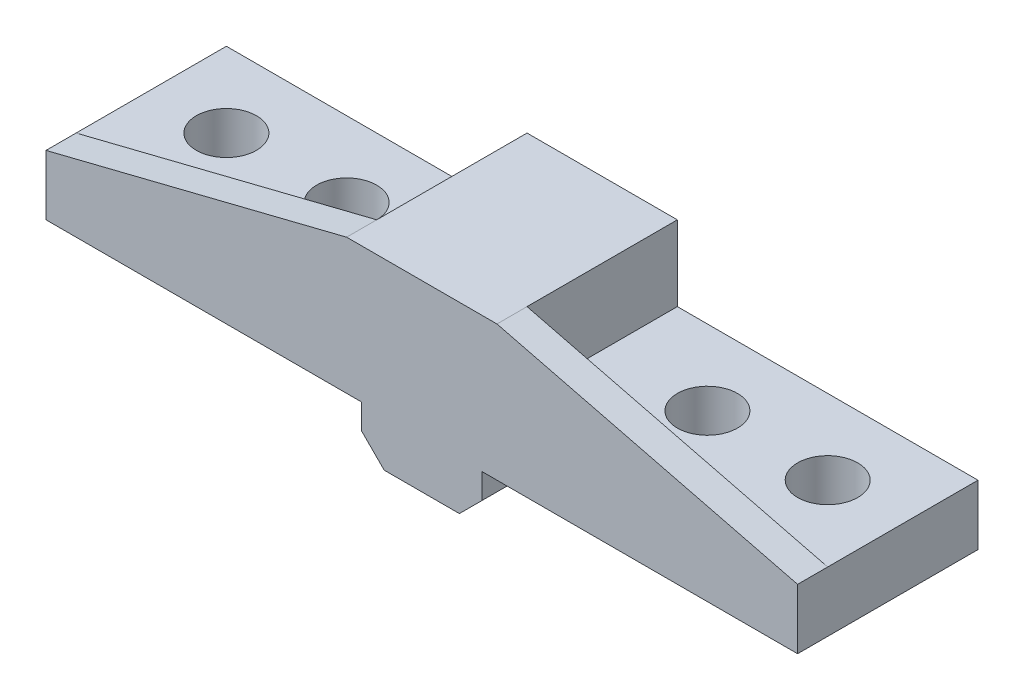
ISO-10303-21;
HEADER;
FILE_DESCRIPTION(('STEP AP214'),'2;1');
FILE_NAME('part.step','',(''),(''),'','','');
FILE_SCHEMA(('AUTOMOTIVE_DESIGN { 1 0 10303 214 1 1 1 1 }'));
ENDSEC;
DATA;
#1=APPLICATION_CONTEXT('core data for automotive mechanical design processes');
#2=APPLICATION_PROTOCOL_DEFINITION('international standard','automotive_design',2000,#1);
#3=PRODUCT_CONTEXT('',#1,'mechanical');
#4=PRODUCT('Part','Part','',(#3));
#5=PRODUCT_RELATED_PRODUCT_CATEGORY('part','',(#4));
#6=PRODUCT_DEFINITION_FORMATION('','',#4);
#7=PRODUCT_DEFINITION_CONTEXT('part definition',#1,'design');
#8=PRODUCT_DEFINITION('design','',#6,#7);
#9=PRODUCT_DEFINITION_SHAPE('','',#8);
#10=(LENGTH_UNIT() NAMED_UNIT(*) SI_UNIT(.MILLI.,.METRE.));
#11=(NAMED_UNIT(*) PLANE_ANGLE_UNIT() SI_UNIT($,.RADIAN.));
#12=(NAMED_UNIT(*) SI_UNIT($,.STERADIAN.) SOLID_ANGLE_UNIT());
#13=UNCERTAINTY_MEASURE_WITH_UNIT(LENGTH_MEASURE(1.E-05),#10,'distance_accuracy_value','');
#14=(GEOMETRIC_REPRESENTATION_CONTEXT(3) GLOBAL_UNCERTAINTY_ASSIGNED_CONTEXT((#13)) GLOBAL_UNIT_ASSIGNED_CONTEXT((#10,
#11,#12)) REPRESENTATION_CONTEXT('',''));
#15=CARTESIAN_POINT('',(0.,0.,0.));
#16=DIRECTION('',(0.,0.,1.));
#17=DIRECTION('',(1.,0.,0.));
#18=AXIS2_PLACEMENT_3D('',#15,#16,#17);
#19=CARTESIAN_POINT('',(-4.,3.175,10.));
#20=DIRECTION('',(0.,1.,0.));
#21=DIRECTION('',(-1.,0.,0.));
#22=AXIS2_PLACEMENT_3D('',#19,#20,#21);
#23=PLANE('',#22);
#24=CARTESIAN_POINT('',(-20.,3.175,5.00000000000001));
#25=DIRECTION('',(0.,1.,0.));
#26=DIRECTION('',(-1.,0.,0.));
#27=AXIS2_PLACEMENT_3D('',#24,#25,#26);
#28=CIRCLE('',#27,2.);
#29=CARTESIAN_POINT('',(-22.,3.175,5.00000000000001));
#30=VERTEX_POINT('',#29);
#31=EDGE_CURVE('E579',#30,#30,#28,.F.);
#32=ORIENTED_EDGE('',*,*,#31,.F.);
#33=EDGE_LOOP('',(#32));
#34=FACE_BOUND('',#33,.T.);
#35=CARTESIAN_POINT('',(-12.,3.175,5.));
#36=DIRECTION('',(0.,1.,0.));
#37=DIRECTION('',(-1.,0.,0.));
#38=AXIS2_PLACEMENT_3D('',#35,#36,#37);
#39=CIRCLE('',#38,2.);
#40=CARTESIAN_POINT('',(-14.,3.175,5.));
#41=VERTEX_POINT('',#40);
#42=EDGE_CURVE('E578',#41,#41,#39,.F.);
#43=ORIENTED_EDGE('',*,*,#42,.F.);
#44=EDGE_LOOP('',(#43));
#45=FACE_BOUND('',#44,.T.);
#46=DIRECTION('',(1.,0.,0.));
#47=VECTOR('',#46,1.);
#48=CARTESIAN_POINT('',(-4.,3.175,0.));
#49=LINE('',#48,#47);
#50=CARTESIAN_POINT('',(-25.,3.175,0.));
#51=VERTEX_POINT('',#50);
#52=CARTESIAN_POINT('',(-4.,3.175,0.));
#53=VERTEX_POINT('',#52);
#54=EDGE_CURVE('E184',#51,#53,#49,.T.);
#55=ORIENTED_EDGE('',*,*,#54,.T.);
#56=DIRECTION('',(0.,0.,-1.));
#57=VECTOR('',#56,1.);
#58=CARTESIAN_POINT('',(-4.,3.175,10.));
#59=LINE('',#58,#57);
#60=CARTESIAN_POINT('',(-4.,3.175,12.));
#61=VERTEX_POINT('',#60);
#62=EDGE_CURVE('E252',#61,#53,#59,.T.);
#63=ORIENTED_EDGE('',*,*,#62,.F.);
#64=DIRECTION('',(1.,0.,0.));
#65=VECTOR('',#64,1.);
#66=CARTESIAN_POINT('',(-4.,3.175,12.));
#67=LINE('',#66,#65);
#68=CARTESIAN_POINT('',(-25.,3.175,12.));
#69=VERTEX_POINT('',#68);
#70=EDGE_CURVE('E569',#69,#61,#67,.T.);
#71=ORIENTED_EDGE('',*,*,#70,.F.);
#72=DIRECTION('',(0.,0.,-1.));
#73=VECTOR('',#72,1.);
#74=CARTESIAN_POINT('',(-25.,3.175,10.));
#75=LINE('',#74,#73);
#76=EDGE_CURVE('E205',#69,#51,#75,.T.);
#77=ORIENTED_EDGE('',*,*,#76,.T.);
#78=EDGE_LOOP('',(#55,#63,#71,#77));
#79=FACE_BOUND('',#78,.T.);
#80=ADVANCED_FACE('F41',(#34,#45,#79),#23,.F.);
#81=CARTESIAN_POINT('',(-4.,0.,10.));
#82=DIRECTION('',(1.,0.,0.));
#83=DIRECTION('',(0.,0.,-1.));
#84=AXIS2_PLACEMENT_3D('',#81,#82,#83);
#85=PLANE('',#84);
#86=DIRECTION('',(0.,-1.,0.));
#87=VECTOR('',#86,1.);
#88=CARTESIAN_POINT('',(-4.,0.,0.));
#89=LINE('',#88,#87);
#90=CARTESIAN_POINT('',(-4.,1.5,0.));
#91=VERTEX_POINT('',#90);
#92=EDGE_CURVE('E187',#53,#91,#89,.T.);
#93=ORIENTED_EDGE('',*,*,#92,.T.);
#94=DIRECTION('',(0.,0.,1.));
#95=VECTOR('',#94,1.);
#96=CARTESIAN_POINT('',(-4.,1.5,10.));
#97=LINE('',#96,#95);
#98=CARTESIAN_POINT('',(-4.,1.5,12.));
#99=VERTEX_POINT('',#98);
#100=EDGE_CURVE('E65',#91,#99,#97,.T.);
#101=ORIENTED_EDGE('',*,*,#100,.T.);
#102=DIRECTION('',(0.,-1.,0.));
#103=VECTOR('',#102,1.);
#104=CARTESIAN_POINT('',(-4.,0.,12.));
#105=LINE('',#104,#103);
#106=EDGE_CURVE('E269',#61,#99,#105,.T.);
#107=ORIENTED_EDGE('',*,*,#106,.F.);
#108=ORIENTED_EDGE('',*,*,#62,.T.);
#109=EDGE_LOOP('',(#93,#101,#107,#108));
#110=FACE_BOUND('',#109,.T.);
#111=ADVANCED_FACE('F282',(#110),#85,.F.);
#112=CARTESIAN_POINT('',(4.,0.,10.));
#113=DIRECTION('',(0.,1.,0.));
#114=DIRECTION('',(-1.,0.,0.));
#115=AXIS2_PLACEMENT_3D('',#112,#113,#114);
#116=PLANE('',#115);
#117=DIRECTION('',(1.,0.,0.));
#118=VECTOR('',#117,1.);
#119=CARTESIAN_POINT('',(4.,0.,12.));
#120=LINE('',#119,#118);
#121=CARTESIAN_POINT('',(-2.50000000000001,0.,12.));
#122=VERTEX_POINT('',#121);
#123=CARTESIAN_POINT('',(2.49999999999998,0.,12.));
#124=VERTEX_POINT('',#123);
#125=EDGE_CURVE('E267',#122,#124,#120,.T.);
#126=ORIENTED_EDGE('',*,*,#125,.F.);
#127=DIRECTION('',(0.,0.,-1.));
#128=VECTOR('',#127,1.);
#129=CARTESIAN_POINT('',(-2.50000000000001,0.,10.));
#130=LINE('',#129,#128);
#131=CARTESIAN_POINT('',(-2.50000000000001,0.,0.));
#132=VERTEX_POINT('',#131);
#133=EDGE_CURVE('E257',#122,#132,#130,.T.);
#134=ORIENTED_EDGE('',*,*,#133,.T.);
#135=DIRECTION('',(1.,0.,0.));
#136=VECTOR('',#135,1.);
#137=CARTESIAN_POINT('',(4.,0.,0.));
#138=LINE('',#137,#136);
#139=CARTESIAN_POINT('',(2.49999999999998,0.,0.));
#140=VERTEX_POINT('',#139);
#141=EDGE_CURVE('E208',#132,#140,#138,.T.);
#142=ORIENTED_EDGE('',*,*,#141,.T.);
#143=DIRECTION('',(0.,0.,1.));
#144=VECTOR('',#143,1.);
#145=CARTESIAN_POINT('',(2.49999999999998,0.,10.));
#146=LINE('',#145,#144);
#147=EDGE_CURVE('E255',#140,#124,#146,.T.);
#148=ORIENTED_EDGE('',*,*,#147,.T.);
#149=EDGE_LOOP('',(#126,#134,#142,#148));
#150=FACE_BOUND('',#149,.T.);
#151=ADVANCED_FACE('F273',(#150),#116,.F.);
#152=CARTESIAN_POINT('',(4.,0.,10.));
#153=DIRECTION('',(-1.,0.,0.));
#154=DIRECTION('',(0.,-1.,0.));
#155=AXIS2_PLACEMENT_3D('',#152,#153,#154);
#156=PLANE('',#155);
#157=DIRECTION('',(0.,1.,0.));
#158=VECTOR('',#157,1.);
#159=CARTESIAN_POINT('',(4.,3.17500000000001,12.));
#160=LINE('',#159,#158);
#161=CARTESIAN_POINT('',(4.,1.50000000000001,12.));
#162=VERTEX_POINT('',#161);
#163=CARTESIAN_POINT('',(4.,3.17500000000001,12.));
#164=VERTEX_POINT('',#163);
#165=EDGE_CURVE('E276',#162,#164,#160,.T.);
#166=ORIENTED_EDGE('',*,*,#165,.F.);
#167=DIRECTION('',(0.,0.,-1.));
#168=VECTOR('',#167,1.);
#169=CARTESIAN_POINT('',(4.,1.50000000000001,10.));
#170=LINE('',#169,#168);
#171=CARTESIAN_POINT('',(4.,1.50000000000001,0.));
#172=VERTEX_POINT('',#171);
#173=EDGE_CURVE('E11',#162,#172,#170,.T.);
#174=ORIENTED_EDGE('',*,*,#173,.T.);
#175=DIRECTION('',(0.,1.,0.));
#176=VECTOR('',#175,1.);
#177=CARTESIAN_POINT('',(4.,0.,0.));
#178=LINE('',#177,#176);
#179=CARTESIAN_POINT('',(4.,3.17500000000001,0.));
#180=VERTEX_POINT('',#179);
#181=EDGE_CURVE('E211',#172,#180,#178,.T.);
#182=ORIENTED_EDGE('',*,*,#181,.T.);
#183=DIRECTION('',(0.,0.,-1.));
#184=VECTOR('',#183,1.);
#185=CARTESIAN_POINT('',(4.,3.17500000000001,10.));
#186=LINE('',#185,#184);
#187=EDGE_CURVE('E249',#164,#180,#186,.T.);
#188=ORIENTED_EDGE('',*,*,#187,.F.);
#189=EDGE_LOOP('',(#166,#174,#182,#188));
#190=FACE_BOUND('',#189,.T.);
#191=ADVANCED_FACE('F472',(#190),#156,.F.);
#192=CARTESIAN_POINT('',(4.,3.17500000000001,10.));
#193=DIRECTION('',(0.,1.,0.));
#194=DIRECTION('',(-1.,0.,0.));
#195=AXIS2_PLACEMENT_3D('',#192,#193,#194);
#196=PLANE('',#195);
#197=CARTESIAN_POINT('',(20.,3.175,5.));
#198=DIRECTION('',(0.,1.,0.));
#199=DIRECTION('',(-1.,0.,0.));
#200=AXIS2_PLACEMENT_3D('',#197,#198,#199);
#201=CIRCLE('',#200,2.);
#202=CARTESIAN_POINT('',(18.,3.175,5.));
#203=VERTEX_POINT('',#202);
#204=EDGE_CURVE('E585',#203,#203,#201,.F.);
#205=ORIENTED_EDGE('',*,*,#204,.F.);
#206=EDGE_LOOP('',(#205));
#207=FACE_BOUND('',#206,.T.);
#208=CARTESIAN_POINT('',(12.,3.175,5.));
#209=DIRECTION('',(0.,1.,0.));
#210=DIRECTION('',(-1.,0.,0.));
#211=AXIS2_PLACEMENT_3D('',#208,#209,#210);
#212=CIRCLE('',#211,2.);
#213=CARTESIAN_POINT('',(9.99999999999999,3.175,5.));
#214=VERTEX_POINT('',#213);
#215=EDGE_CURVE('E297',#214,#214,#212,.F.);
#216=ORIENTED_EDGE('',*,*,#215,.F.);
#217=EDGE_LOOP('',(#216));
#218=FACE_BOUND('',#217,.T.);
#219=DIRECTION('',(1.,0.,0.));
#220=VECTOR('',#219,1.);
#221=CARTESIAN_POINT('',(4.,3.17500000000001,0.));
#222=LINE('',#221,#220);
#223=CARTESIAN_POINT('',(25.,3.175,0.));
#224=VERTEX_POINT('',#223);
#225=EDGE_CURVE('E213',#180,#224,#222,.T.);
#226=ORIENTED_EDGE('',*,*,#225,.T.);
#227=DIRECTION('',(0.,0.,-1.));
#228=VECTOR('',#227,1.);
#229=CARTESIAN_POINT('',(25.,3.175,10.));
#230=LINE('',#229,#228);
#231=CARTESIAN_POINT('',(25.,3.175,12.));
#232=VERTEX_POINT('',#231);
#233=EDGE_CURVE('E246',#232,#224,#230,.T.);
#234=ORIENTED_EDGE('',*,*,#233,.F.);
#235=DIRECTION('',(1.,0.,0.));
#236=VECTOR('',#235,1.);
#237=CARTESIAN_POINT('',(25.,3.175,12.));
#238=LINE('',#237,#236);
#239=EDGE_CURVE('E560',#164,#232,#238,.T.);
#240=ORIENTED_EDGE('',*,*,#239,.F.);
#241=ORIENTED_EDGE('',*,*,#187,.T.);
#242=EDGE_LOOP('',(#226,#234,#240,#241));
#243=FACE_BOUND('',#242,.T.);
#244=ADVANCED_FACE('F469',(#207,#218,#243),#196,.F.);
#245=CARTESIAN_POINT('',(25.,3.175,10.));
#246=DIRECTION('',(-1.,0.,0.));
#247=DIRECTION('',(0.,-1.,0.));
#248=AXIS2_PLACEMENT_3D('',#245,#246,#247);
#249=PLANE('',#248);
#250=DIRECTION('',(0.,1.,0.));
#251=VECTOR('',#250,1.);
#252=CARTESIAN_POINT('',(25.,3.175,0.));
#253=LINE('',#252,#251);
#254=CARTESIAN_POINT('',(25.,7.175,0.));
#255=VERTEX_POINT('',#254);
#256=EDGE_CURVE('E215',#224,#255,#253,.T.);
#257=ORIENTED_EDGE('',*,*,#256,.T.);
#258=DIRECTION('',(0.,0.,-1.));
#259=VECTOR('',#258,1.);
#260=CARTESIAN_POINT('',(25.,7.175,10.));
#261=LINE('',#260,#259);
#262=CARTESIAN_POINT('',(25.,7.175,10.));
#263=VERTEX_POINT('',#262);
#264=EDGE_CURVE('E243',#263,#255,#261,.T.);
#265=ORIENTED_EDGE('',*,*,#264,.F.);
#266=DIRECTION('',(0.,0.,-1.));
#267=VECTOR('',#266,1.);
#268=CARTESIAN_POINT('',(25.,7.175,12.));
#269=LINE('',#268,#267);
#270=CARTESIAN_POINT('',(25.,7.175,12.));
#271=VERTEX_POINT('',#270);
#272=EDGE_CURVE('E189',#271,#263,#269,.T.);
#273=ORIENTED_EDGE('',*,*,#272,.F.);
#274=DIRECTION('',(0.,1.,0.));
#275=VECTOR('',#274,1.);
#276=CARTESIAN_POINT('',(25.,3.175,12.));
#277=LINE('',#276,#275);
#278=EDGE_CURVE('E565',#232,#271,#277,.T.);
#279=ORIENTED_EDGE('',*,*,#278,.F.);
#280=ORIENTED_EDGE('',*,*,#233,.T.);
#281=EDGE_LOOP('',(#257,#265,#273,#279,#280));
#282=FACE_BOUND('',#281,.T.);
#283=ADVANCED_FACE('F461',(#282),#249,.F.);
#284=CARTESIAN_POINT('',(25.,7.175,10.));
#285=DIRECTION('',(0.,-1.,0.));
#286=DIRECTION('',(1.,0.,0.));
#287=AXIS2_PLACEMENT_3D('',#284,#285,#286);
#288=PLANE('',#287);
#289=CARTESIAN_POINT('',(20.,7.175,5.));
#290=DIRECTION('',(0.,1.,0.));
#291=DIRECTION('',(-1.,0.,0.));
#292=AXIS2_PLACEMENT_3D('',#289,#290,#291);
#293=CIRCLE('',#292,2.);
#294=CARTESIAN_POINT('',(18.,7.175,5.));
#295=VERTEX_POINT('',#294);
#296=EDGE_CURVE('E574',#295,#295,#293,.T.);
#297=ORIENTED_EDGE('',*,*,#296,.F.);
#298=EDGE_LOOP('',(#297));
#299=FACE_BOUND('',#298,.T.);
#300=CARTESIAN_POINT('',(12.,7.175,5.));
#301=DIRECTION('',(0.,1.,0.));
#302=DIRECTION('',(-1.,0.,0.));
#303=AXIS2_PLACEMENT_3D('',#300,#301,#302);
#304=CIRCLE('',#303,2.);
#305=CARTESIAN_POINT('',(9.99999999999999,7.175,5.));
#306=VERTEX_POINT('',#305);
#307=EDGE_CURVE('E302',#306,#306,#304,.T.);
#308=ORIENTED_EDGE('',*,*,#307,.F.);
#309=EDGE_LOOP('',(#308));
#310=FACE_BOUND('',#309,.T.);
#311=DIRECTION('',(-1.,0.,0.));
#312=VECTOR('',#311,1.);
#313=CARTESIAN_POINT('',(25.,7.175,0.));
#314=LINE('',#313,#312);
#315=CARTESIAN_POINT('',(5.,7.175,0.));
#316=VERTEX_POINT('',#315);
#317=EDGE_CURVE('E217',#255,#316,#314,.T.);
#318=ORIENTED_EDGE('',*,*,#317,.T.);
#319=DIRECTION('',(0.,0.,-1.));
#320=VECTOR('',#319,1.);
#321=CARTESIAN_POINT('',(5.,7.175,10.));
#322=LINE('',#321,#320);
#323=CARTESIAN_POINT('',(5.,7.175,10.));
#324=VERTEX_POINT('',#323);
#325=EDGE_CURVE('E240',#324,#316,#322,.T.);
#326=ORIENTED_EDGE('',*,*,#325,.F.);
#327=DIRECTION('',(-1.,0.,0.));
#328=VECTOR('',#327,1.);
#329=CARTESIAN_POINT('',(25.,7.175,10.));
#330=LINE('',#329,#328);
#331=EDGE_CURVE('E193',#263,#324,#330,.T.);
#332=ORIENTED_EDGE('',*,*,#331,.F.);
#333=ORIENTED_EDGE('',*,*,#264,.T.);
#334=EDGE_LOOP('',(#318,#326,#332,#333));
#335=FACE_BOUND('',#334,.T.);
#336=ADVANCED_FACE('F458',(#299,#310,#335),#288,.F.);
#337=CARTESIAN_POINT('',(5.,7.175,10.));
#338=DIRECTION('',(-1.,0.,0.));
#339=DIRECTION('',(0.,-1.,0.));
#340=AXIS2_PLACEMENT_3D('',#337,#338,#339);
#341=PLANE('',#340);
#342=DIRECTION('',(0.,1.,0.));
#343=VECTOR('',#342,1.);
#344=CARTESIAN_POINT('',(5.,7.175,0.));
#345=LINE('',#344,#343);
#346=CARTESIAN_POINT('',(5.,12.175,0.));
#347=VERTEX_POINT('',#346);
#348=EDGE_CURVE('E219',#316,#347,#345,.T.);
#349=ORIENTED_EDGE('',*,*,#348,.T.);
#350=DIRECTION('',(0.,0.,-1.));
#351=VECTOR('',#350,1.);
#352=CARTESIAN_POINT('',(5.,12.175,10.));
#353=LINE('',#352,#351);
#354=CARTESIAN_POINT('',(5.,12.175,10.));
#355=VERTEX_POINT('',#354);
#356=EDGE_CURVE('E237',#355,#347,#353,.T.);
#357=ORIENTED_EDGE('',*,*,#356,.F.);
#358=DIRECTION('',(0.,1.,0.));
#359=VECTOR('',#358,1.);
#360=CARTESIAN_POINT('',(5.,7.175,10.));
#361=LINE('',#360,#359);
#362=EDGE_CURVE('E196',#324,#355,#361,.T.);
#363=ORIENTED_EDGE('',*,*,#362,.F.);
#364=ORIENTED_EDGE('',*,*,#325,.T.);
#365=EDGE_LOOP('',(#349,#357,#363,#364));
#366=FACE_BOUND('',#365,.T.);
#367=ADVANCED_FACE('F320',(#366),#341,.F.);
#368=CARTESIAN_POINT('',(-5.,12.175,10.));
#369=DIRECTION('',(0.,-1.,0.));
#370=DIRECTION('',(1.,0.,0.));
#371=AXIS2_PLACEMENT_3D('',#368,#369,#370);
#372=PLANE('',#371);
#373=DIRECTION('',(-1.,0.,0.));
#374=VECTOR('',#373,1.);
#375=CARTESIAN_POINT('',(-5.,12.175,0.));
#376=LINE('',#375,#374);
#377=CARTESIAN_POINT('',(-5.,12.175,0.));
#378=VERTEX_POINT('',#377);
#379=EDGE_CURVE('E221',#347,#378,#376,.T.);
#380=ORIENTED_EDGE('',*,*,#379,.T.);
#381=DIRECTION('',(0.,0.,-1.));
#382=VECTOR('',#381,1.);
#383=CARTESIAN_POINT('',(-5.,12.175,10.));
#384=LINE('',#383,#382);
#385=CARTESIAN_POINT('',(-5.,12.175,10.));
#386=VERTEX_POINT('',#385);
#387=EDGE_CURVE('E182',#386,#378,#384,.T.);
#388=ORIENTED_EDGE('',*,*,#387,.F.);
#389=DIRECTION('',(0.,0.,-1.));
#390=VECTOR('',#389,1.);
#391=CARTESIAN_POINT('',(-5.,12.175,12.));
#392=LINE('',#391,#390);
#393=CARTESIAN_POINT('',(-5.,12.175,12.));
#394=VERTEX_POINT('',#393);
#395=EDGE_CURVE('E163',#394,#386,#392,.T.);
#396=ORIENTED_EDGE('',*,*,#395,.F.);
#397=DIRECTION('',(-1.,0.,0.));
#398=VECTOR('',#397,1.);
#399=CARTESIAN_POINT('',(5.,12.175,12.));
#400=LINE('',#399,#398);
#401=CARTESIAN_POINT('',(5.,12.175,12.));
#402=VERTEX_POINT('',#401);
#403=EDGE_CURVE('E169',#402,#394,#400,.T.);
#404=ORIENTED_EDGE('',*,*,#403,.F.);
#405=DIRECTION('',(0.,0.,-1.));
#406=VECTOR('',#405,1.);
#407=CARTESIAN_POINT('',(5.,12.175,12.));
#408=LINE('',#407,#406);
#409=EDGE_CURVE('E307',#402,#355,#408,.T.);
#410=ORIENTED_EDGE('',*,*,#409,.T.);
#411=ORIENTED_EDGE('',*,*,#356,.T.);
#412=EDGE_LOOP('',(#380,#388,#396,#404,#410,#411));
#413=FACE_BOUND('',#412,.T.);
#414=ADVANCED_FACE('F180',(#413),#372,.F.);
#415=CARTESIAN_POINT('',(-5.,7.175,10.));
#416=DIRECTION('',(1.,0.,0.));
#417=DIRECTION('',(0.,0.,-1.));
#418=AXIS2_PLACEMENT_3D('',#415,#416,#417);
#419=PLANE('',#418);
#420=DIRECTION('',(0.,-1.,0.));
#421=VECTOR('',#420,1.);
#422=CARTESIAN_POINT('',(-5.,7.175,0.));
#423=LINE('',#422,#421);
#424=CARTESIAN_POINT('',(-5.,7.175,0.));
#425=VERTEX_POINT('',#424);
#426=EDGE_CURVE('E223',#378,#425,#423,.T.);
#427=ORIENTED_EDGE('',*,*,#426,.T.);
#428=DIRECTION('',(0.,0.,-1.));
#429=VECTOR('',#428,1.);
#430=CARTESIAN_POINT('',(-5.,7.175,10.));
#431=LINE('',#430,#429);
#432=CARTESIAN_POINT('',(-5.,7.175,10.));
#433=VERTEX_POINT('',#432);
#434=EDGE_CURVE('E233',#433,#425,#431,.T.);
#435=ORIENTED_EDGE('',*,*,#434,.F.);
#436=DIRECTION('',(0.,-1.,0.));
#437=VECTOR('',#436,1.);
#438=CARTESIAN_POINT('',(-5.,7.175,10.));
#439=LINE('',#438,#437);
#440=EDGE_CURVE('E200',#386,#433,#439,.T.);
#441=ORIENTED_EDGE('',*,*,#440,.F.);
#442=ORIENTED_EDGE('',*,*,#387,.T.);
#443=EDGE_LOOP('',(#427,#435,#441,#442));
#444=FACE_BOUND('',#443,.T.);
#445=ADVANCED_FACE('F325',(#444),#419,.F.);
#446=CARTESIAN_POINT('',(-25.,7.175,10.));
#447=DIRECTION('',(0.,-1.,0.));
#448=DIRECTION('',(1.,0.,0.));
#449=AXIS2_PLACEMENT_3D('',#446,#447,#448);
#450=PLANE('',#449);
#451=CARTESIAN_POINT('',(-20.,7.17499999999999,5.00000000000001));
#452=DIRECTION('',(0.,1.,0.));
#453=DIRECTION('',(1.,0.,0.));
#454=AXIS2_PLACEMENT_3D('',#451,#452,#453);
#455=CIRCLE('',#454,2.);
#456=CARTESIAN_POINT('',(-18.,7.17499999999999,5.00000000000001));
#457=VERTEX_POINT('',#456);
#458=EDGE_CURVE('E575',#457,#457,#455,.T.);
#459=ORIENTED_EDGE('',*,*,#458,.F.);
#460=EDGE_LOOP('',(#459));
#461=FACE_BOUND('',#460,.T.);
#462=CARTESIAN_POINT('',(-12.,7.175,5.));
#463=DIRECTION('',(0.,1.,0.));
#464=DIRECTION('',(1.,0.,0.));
#465=AXIS2_PLACEMENT_3D('',#462,#463,#464);
#466=CIRCLE('',#465,2.);
#467=CARTESIAN_POINT('',(-10.,7.175,5.));
#468=VERTEX_POINT('',#467);
#469=EDGE_CURVE('E582',#468,#468,#466,.T.);
#470=ORIENTED_EDGE('',*,*,#469,.F.);
#471=EDGE_LOOP('',(#470));
#472=FACE_BOUND('',#471,.T.);
#473=DIRECTION('',(-1.,0.,0.));
#474=VECTOR('',#473,1.);
#475=CARTESIAN_POINT('',(-25.,7.175,0.));
#476=LINE('',#475,#474);
#477=CARTESIAN_POINT('',(-25.,7.175,0.));
#478=VERTEX_POINT('',#477);
#479=EDGE_CURVE('E225',#425,#478,#476,.T.);
#480=ORIENTED_EDGE('',*,*,#479,.T.);
#481=DIRECTION('',(0.,0.,-1.));
#482=VECTOR('',#481,1.);
#483=CARTESIAN_POINT('',(-25.,7.175,10.));
#484=LINE('',#483,#482);
#485=CARTESIAN_POINT('',(-25.,7.175,10.));
#486=VERTEX_POINT('',#485);
#487=EDGE_CURVE('E230',#486,#478,#484,.T.);
#488=ORIENTED_EDGE('',*,*,#487,.F.);
#489=DIRECTION('',(-1.,0.,0.));
#490=VECTOR('',#489,1.);
#491=CARTESIAN_POINT('',(-25.,7.175,10.));
#492=LINE('',#491,#490);
#493=EDGE_CURVE('E203',#433,#486,#492,.T.);
#494=ORIENTED_EDGE('',*,*,#493,.F.);
#495=ORIENTED_EDGE('',*,*,#434,.T.);
#496=EDGE_LOOP('',(#480,#488,#494,#495));
#497=FACE_BOUND('',#496,.T.);
#498=ADVANCED_FACE('F292',(#461,#472,#497),#450,.F.);
#499=CARTESIAN_POINT('',(-25.,3.175,10.));
#500=DIRECTION('',(1.,0.,0.));
#501=DIRECTION('',(0.,1.,0.));
#502=AXIS2_PLACEMENT_3D('',#499,#500,#501);
#503=PLANE('',#502);
#504=DIRECTION('',(0.,-1.,0.));
#505=VECTOR('',#504,1.);
#506=CARTESIAN_POINT('',(-25.,3.175,0.));
#507=LINE('',#506,#505);
#508=EDGE_CURVE('E197',#478,#51,#507,.T.);
#509=ORIENTED_EDGE('',*,*,#508,.T.);
#510=ORIENTED_EDGE('',*,*,#76,.F.);
#511=DIRECTION('',(0.,-1.,0.));
#512=VECTOR('',#511,1.);
#513=CARTESIAN_POINT('',(-25.,7.175,12.));
#514=LINE('',#513,#512);
#515=CARTESIAN_POINT('',(-25.,7.175,12.));
#516=VERTEX_POINT('',#515);
#517=EDGE_CURVE('E168',#516,#69,#514,.T.);
#518=ORIENTED_EDGE('',*,*,#517,.F.);
#519=DIRECTION('',(0.,0.,-1.));
#520=VECTOR('',#519,1.);
#521=CARTESIAN_POINT('',(-25.,7.175,12.));
#522=LINE('',#521,#520);
#523=EDGE_CURVE('E165',#516,#486,#522,.T.);
#524=ORIENTED_EDGE('',*,*,#523,.T.);
#525=ORIENTED_EDGE('',*,*,#487,.T.);
#526=EDGE_LOOP('',(#509,#510,#518,#524,#525));
#527=FACE_BOUND('',#526,.T.);
#528=ADVANCED_FACE('F289',(#527),#503,.F.);
#529=CARTESIAN_POINT('',(0.,0.,0.));
#530=DIRECTION('',(0.,0.,-1.));
#531=DIRECTION('',(-1.,0.,0.));
#532=AXIS2_PLACEMENT_3D('',#529,#530,#531);
#533=PLANE('',#532);
#534=ORIENTED_EDGE('',*,*,#141,.F.);
#535=DIRECTION('',(0.707106781186546,-0.707106781186549,0.));
#536=VECTOR('',#535,1.);
#537=CARTESIAN_POINT('',(-1.25000000000001,-1.25000000000001,0.));
#538=LINE('',#537,#536);
#539=EDGE_CURVE('E262',#132,#91,#538,.F.);
#540=ORIENTED_EDGE('',*,*,#539,.T.);
#541=ORIENTED_EDGE('',*,*,#92,.F.);
#542=ORIENTED_EDGE('',*,*,#54,.F.);
#543=ORIENTED_EDGE('',*,*,#508,.F.);
#544=ORIENTED_EDGE('',*,*,#479,.F.);
#545=ORIENTED_EDGE('',*,*,#426,.F.);
#546=ORIENTED_EDGE('',*,*,#379,.F.);
#547=ORIENTED_EDGE('',*,*,#348,.F.);
#548=ORIENTED_EDGE('',*,*,#317,.F.);
#549=ORIENTED_EDGE('',*,*,#256,.F.);
#550=ORIENTED_EDGE('',*,*,#225,.F.);
#551=ORIENTED_EDGE('',*,*,#181,.F.);
#552=DIRECTION('',(0.707106781186549,0.707106781186546,0.));
#553=VECTOR('',#552,1.);
#554=CARTESIAN_POINT('',(1.24999999999998,-1.24999999999999,0.));
#555=LINE('',#554,#553);
#556=EDGE_CURVE('E260',#172,#140,#555,.F.);
#557=ORIENTED_EDGE('',*,*,#556,.T.);
#558=EDGE_LOOP('',(#534,#540,#541,#542,#543,#544,#545,#546,#547,#548,#549,#550,#551,#557));
#559=FACE_BOUND('',#558,.T.);
#560=ADVANCED_FACE('F280',(#559),#533,.T.);
#561=CARTESIAN_POINT('',(0.,0.,10.));
#562=DIRECTION('',(0.,0.,1.));
#563=DIRECTION('',(1.,0.,0.));
#564=AXIS2_PLACEMENT_3D('',#561,#562,#563);
#565=PLANE('',#564);
#566=DIRECTION('',(-0.970142500145332,0.242535625036333,0.));
#567=VECTOR('',#566,1.);
#568=CARTESIAN_POINT('',(25.,7.175,10.));
#569=LINE('',#568,#567);
#570=EDGE_CURVE('E178',#263,#355,#569,.T.);
#571=ORIENTED_EDGE('',*,*,#570,.F.);
#572=ORIENTED_EDGE('',*,*,#331,.T.);
#573=ORIENTED_EDGE('',*,*,#362,.T.);
#574=EDGE_LOOP('',(#571,#572,#573));
#575=FACE_BOUND('',#574,.T.);
#576=ADVANCED_FACE('F316',(#575),#565,.F.);
#577=DIRECTION('',(-0.970142500145332,-0.242535625036333,0.));
#578=VECTOR('',#577,1.);
#579=CARTESIAN_POINT('',(-5.,12.175,10.));
#580=LINE('',#579,#578);
#581=EDGE_CURVE('E296',#386,#486,#580,.T.);
#582=ORIENTED_EDGE('',*,*,#581,.F.);
#583=ORIENTED_EDGE('',*,*,#440,.T.);
#584=ORIENTED_EDGE('',*,*,#493,.T.);
#585=EDGE_LOOP('',(#582,#583,#584));
#586=FACE_BOUND('',#585,.T.);
#587=ADVANCED_FACE('F295',(#586),#565,.F.);
#588=CARTESIAN_POINT('',(-5.,12.175,12.));
#589=DIRECTION('',(0.242535625036333,-0.970142500145332,0.));
#590=DIRECTION('',(0.970142500145332,0.242535625036333,0.));
#591=AXIS2_PLACEMENT_3D('',#588,#589,#590);
#592=PLANE('',#591);
#593=ORIENTED_EDGE('',*,*,#581,.T.);
#594=ORIENTED_EDGE('',*,*,#523,.F.);
#595=DIRECTION('',(-0.970142500145332,-0.242535625036333,0.));
#596=VECTOR('',#595,1.);
#597=CARTESIAN_POINT('',(-5.,12.175,12.));
#598=LINE('',#597,#596);
#599=EDGE_CURVE('E158',#394,#516,#598,.T.);
#600=ORIENTED_EDGE('',*,*,#599,.F.);
#601=ORIENTED_EDGE('',*,*,#395,.T.);
#602=EDGE_LOOP('',(#593,#594,#600,#601));
#603=FACE_BOUND('',#602,.T.);
#604=ADVANCED_FACE('F161',(#603),#592,.F.);
#605=CARTESIAN_POINT('',(25.,7.175,12.));
#606=DIRECTION('',(-0.242535625036333,-0.970142500145332,0.));
#607=DIRECTION('',(0.970142500145332,-0.242535625036333,0.));
#608=AXIS2_PLACEMENT_3D('',#605,#606,#607);
#609=PLANE('',#608);
#610=ORIENTED_EDGE('',*,*,#570,.T.);
#611=ORIENTED_EDGE('',*,*,#409,.F.);
#612=DIRECTION('',(-0.970142500145332,0.242535625036333,0.));
#613=VECTOR('',#612,1.);
#614=CARTESIAN_POINT('',(25.,7.175,12.));
#615=LINE('',#614,#613);
#616=EDGE_CURVE('E174',#271,#402,#615,.T.);
#617=ORIENTED_EDGE('',*,*,#616,.F.);
#618=ORIENTED_EDGE('',*,*,#272,.T.);
#619=EDGE_LOOP('',(#610,#611,#617,#618));
#620=FACE_BOUND('',#619,.T.);
#621=ADVANCED_FACE('F312',(#620),#609,.F.);
#622=CARTESIAN_POINT('',(0.,0.,12.));
#623=DIRECTION('',(0.,0.,1.));
#624=DIRECTION('',(1.,0.,0.));
#625=AXIS2_PLACEMENT_3D('',#622,#623,#624);
#626=PLANE('',#625);
#627=ORIENTED_EDGE('',*,*,#106,.T.);
#628=DIRECTION('',(-0.707106781186546,0.707106781186549,0.));
#629=VECTOR('',#628,1.);
#630=CARTESIAN_POINT('',(-1.25000000000001,-1.25000000000001,12.));
#631=LINE('',#630,#629);
#632=EDGE_CURVE('E50',#99,#122,#631,.F.);
#633=ORIENTED_EDGE('',*,*,#632,.T.);
#634=ORIENTED_EDGE('',*,*,#125,.T.);
#635=DIRECTION('',(-0.707106781186549,-0.707106781186546,0.));
#636=VECTOR('',#635,1.);
#637=CARTESIAN_POINT('',(1.24999999999998,-1.24999999999999,12.));
#638=LINE('',#637,#636);
#639=EDGE_CURVE('E57',#124,#162,#638,.F.);
#640=ORIENTED_EDGE('',*,*,#639,.T.);
#641=ORIENTED_EDGE('',*,*,#165,.T.);
#642=ORIENTED_EDGE('',*,*,#239,.T.);
#643=ORIENTED_EDGE('',*,*,#278,.T.);
#644=ORIENTED_EDGE('',*,*,#616,.T.);
#645=ORIENTED_EDGE('',*,*,#403,.T.);
#646=ORIENTED_EDGE('',*,*,#599,.T.);
#647=ORIENTED_EDGE('',*,*,#517,.T.);
#648=ORIENTED_EDGE('',*,*,#70,.T.);
#649=EDGE_LOOP('',(#627,#633,#634,#640,#641,#642,#643,#644,#645,#646,#647,#648));
#650=FACE_BOUND('',#649,.T.);
#651=ADVANCED_FACE('F172',(#650),#626,.T.);
#652=CARTESIAN_POINT('',(-12.,-2.48185424949239,5.));
#653=DIRECTION('',(0.,1.,0.));
#654=DIRECTION('',(-1.,0.,0.));
#655=AXIS2_PLACEMENT_3D('',#652,#653,#654);
#656=CYLINDRICAL_SURFACE('',#655,2.);
#657=ORIENTED_EDGE('',*,*,#42,.T.);
#658=EDGE_LOOP('',(#657));
#659=FACE_BOUND('',#658,.T.);
#660=ORIENTED_EDGE('',*,*,#469,.T.);
#661=EDGE_LOOP('',(#660));
#662=FACE_BOUND('',#661,.T.);
#663=ADVANCED_FACE('F371',(#659,#662),#656,.F.);
#664=CARTESIAN_POINT('',(-20.,-2.48185424949239,5.00000000000001));
#665=DIRECTION('',(0.,1.,0.));
#666=DIRECTION('',(-1.,0.,0.));
#667=AXIS2_PLACEMENT_3D('',#664,#665,#666);
#668=CYLINDRICAL_SURFACE('',#667,2.);
#669=ORIENTED_EDGE('',*,*,#31,.T.);
#670=EDGE_LOOP('',(#669));
#671=FACE_BOUND('',#670,.T.);
#672=ORIENTED_EDGE('',*,*,#458,.T.);
#673=EDGE_LOOP('',(#672));
#674=FACE_BOUND('',#673,.T.);
#675=ADVANCED_FACE('F365',(#671,#674),#668,.F.);
#676=CARTESIAN_POINT('',(12.,-2.48185424949239,5.));
#677=DIRECTION('',(0.,1.,0.));
#678=DIRECTION('',(-1.,0.,0.));
#679=AXIS2_PLACEMENT_3D('',#676,#677,#678);
#680=CYLINDRICAL_SURFACE('',#679,2.);
#681=ORIENTED_EDGE('',*,*,#215,.T.);
#682=EDGE_LOOP('',(#681));
#683=FACE_BOUND('',#682,.T.);
#684=ORIENTED_EDGE('',*,*,#307,.T.);
#685=EDGE_LOOP('',(#684));
#686=FACE_BOUND('',#685,.T.);
#687=ADVANCED_FACE('F359',(#683,#686),#680,.F.);
#688=CARTESIAN_POINT('',(20.,-2.48185424949238,5.));
#689=DIRECTION('',(0.,1.,0.));
#690=DIRECTION('',(-1.,0.,0.));
#691=AXIS2_PLACEMENT_3D('',#688,#689,#690);
#692=CYLINDRICAL_SURFACE('',#691,2.);
#693=ORIENTED_EDGE('',*,*,#204,.T.);
#694=EDGE_LOOP('',(#693));
#695=FACE_BOUND('',#694,.T.);
#696=ORIENTED_EDGE('',*,*,#296,.T.);
#697=EDGE_LOOP('',(#696));
#698=FACE_BOUND('',#697,.T.);
#699=ADVANCED_FACE('F352',(#695,#698),#692,.F.);
#700=CARTESIAN_POINT('',(-2.50000000000001,0.,10.));
#701=DIRECTION('',(0.707106781186549,0.707106781186546,0.));
#702=DIRECTION('',(0.,0.,-1.));
#703=AXIS2_PLACEMENT_3D('',#700,#701,#702);
#704=PLANE('',#703);
#705=ORIENTED_EDGE('',*,*,#632,.F.);
#706=ORIENTED_EDGE('',*,*,#100,.F.);
#707=ORIENTED_EDGE('',*,*,#539,.F.);
#708=ORIENTED_EDGE('',*,*,#133,.F.);
#709=EDGE_LOOP('',(#705,#706,#707,#708));
#710=FACE_BOUND('',#709,.T.);
#711=ADVANCED_FACE('F278',(#710),#704,.F.);
#712=CARTESIAN_POINT('',(4.,1.50000000000001,10.));
#713=DIRECTION('',(-0.707106781186546,0.707106781186549,0.));
#714=DIRECTION('',(0.,0.,-1.));
#715=AXIS2_PLACEMENT_3D('',#712,#713,#714);
#716=PLANE('',#715);
#717=ORIENTED_EDGE('',*,*,#639,.F.);
#718=ORIENTED_EDGE('',*,*,#147,.F.);
#719=ORIENTED_EDGE('',*,*,#556,.F.);
#720=ORIENTED_EDGE('',*,*,#173,.F.);
#721=EDGE_LOOP('',(#717,#718,#719,#720));
#722=FACE_BOUND('',#721,.T.);
#723=ADVANCED_FACE('F44',(#722),#716,.F.);
#724=CLOSED_SHELL('',(#80,#111,#151,#191,#244,#283,#336,#367,#414,#445,#498,#528,#560,#576,#587,
#604,#621,#651,#663,#675,#687,#699,#711,#723));
#725=MANIFOLD_SOLID_BREP('B2',#724);
#726=ADVANCED_BREP_SHAPE_REPRESENTATION('',(#18,#725),#14);
#727=SHAPE_DEFINITION_REPRESENTATION(#9,#726);
ENDSEC;
END-ISO-10303-21;
